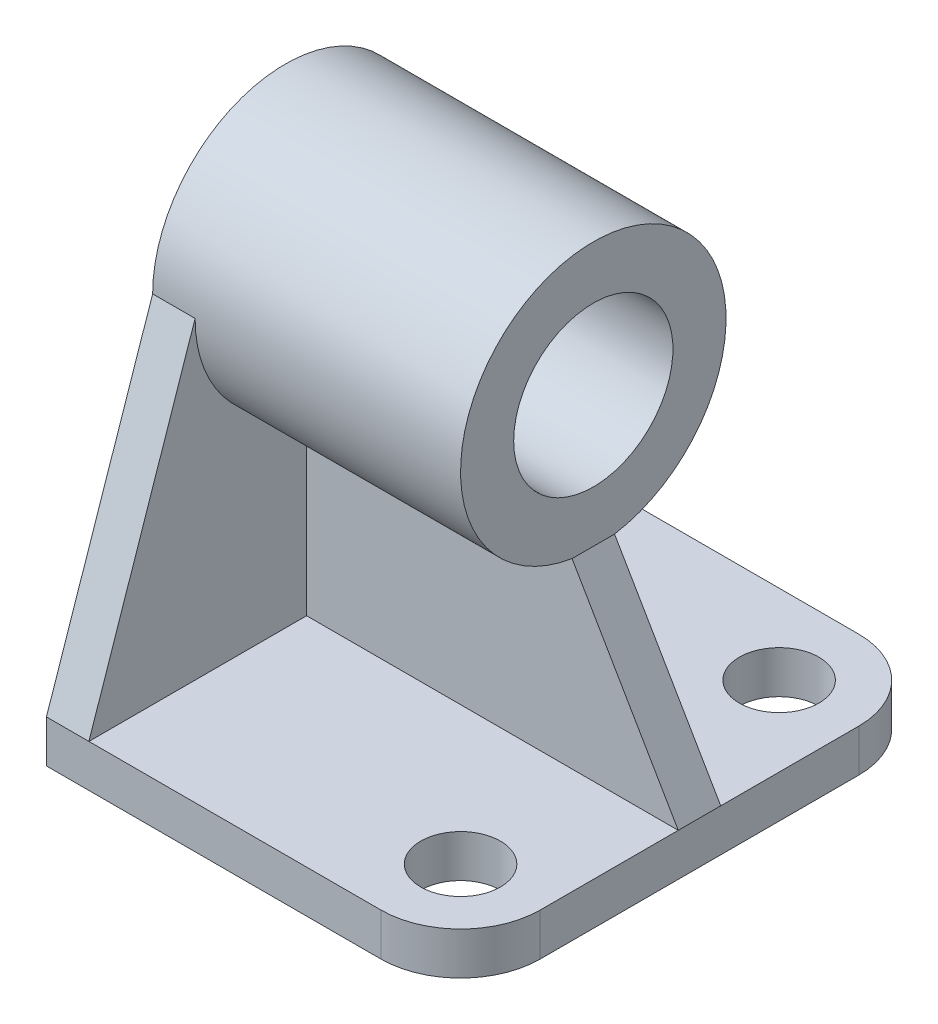
ISO-10303-21;
HEADER;
FILE_DESCRIPTION(('STEP AP214'),'2;1');
FILE_NAME('part.step','',(''),(''),'','','');
FILE_SCHEMA(('AUTOMOTIVE_DESIGN { 1 0 10303 214 1 1 1 1 }'));
ENDSEC;
DATA;
#1=APPLICATION_CONTEXT('core data for automotive mechanical design processes');
#2=APPLICATION_PROTOCOL_DEFINITION('international standard','automotive_design',2000,#1);
#3=PRODUCT_CONTEXT('',#1,'mechanical');
#4=PRODUCT('Part','Part','',(#3));
#5=PRODUCT_RELATED_PRODUCT_CATEGORY('part','',(#4));
#6=PRODUCT_DEFINITION_FORMATION('','',#4);
#7=PRODUCT_DEFINITION_CONTEXT('part definition',#1,'design');
#8=PRODUCT_DEFINITION('design','',#6,#7);
#9=PRODUCT_DEFINITION_SHAPE('','',#8);
#10=(LENGTH_UNIT() NAMED_UNIT(*) SI_UNIT(.MILLI.,.METRE.));
#11=(NAMED_UNIT(*) PLANE_ANGLE_UNIT() SI_UNIT($,.RADIAN.));
#12=(NAMED_UNIT(*) SI_UNIT($,.STERADIAN.) SOLID_ANGLE_UNIT());
#13=UNCERTAINTY_MEASURE_WITH_UNIT(LENGTH_MEASURE(1.E-05),#10,'distance_accuracy_value','');
#14=(GEOMETRIC_REPRESENTATION_CONTEXT(3) GLOBAL_UNCERTAINTY_ASSIGNED_CONTEXT((#13)) GLOBAL_UNIT_ASSIGNED_CONTEXT((#10,
#11,#12)) REPRESENTATION_CONTEXT('',''));
#15=CARTESIAN_POINT('',(0.,0.,0.));
#16=DIRECTION('',(0.,0.,1.));
#17=DIRECTION('',(1.,0.,0.));
#18=AXIS2_PLACEMENT_3D('',#15,#16,#17);
#19=CARTESIAN_POINT('',(58.4548841351671,8.,11.6222556390977));
#20=DIRECTION('',(0.,1.,0.));
#21=DIRECTION('',(0.,0.,1.));
#22=AXIS2_PLACEMENT_3D('',#19,#20,#21);
#23=PLANE('',#22);
#24=DIRECTION('',(-1.,0.,0.));
#25=VECTOR('',#24,1.);
#26=CARTESIAN_POINT('',(73.4548841351671,7.99999999999999,-14.3777443609023));
#27=LINE('',#26,#25);
#28=CARTESIAN_POINT('',(73.4548841351671,8.,-14.3777443609023));
#29=VERTEX_POINT('',#28);
#30=CARTESIAN_POINT('',(3.4548841351671,7.99999999999999,-14.3777443609023));
#31=VERTEX_POINT('',#30);
#32=EDGE_CURVE('E252',#29,#31,#27,.T.);
#33=ORIENTED_EDGE('',*,*,#32,.T.);
#34=DIRECTION('',(0.,0.,-1.));
#35=VECTOR('',#34,1.);
#36=CARTESIAN_POINT('',(3.45488413516711,8.,0.));
#37=LINE('',#36,#35);
#38=CARTESIAN_POINT('',(3.4548841351671,8.,26.6222556390977));
#39=VERTEX_POINT('',#38);
#40=EDGE_CURVE('E55',#39,#31,#37,.T.);
#41=ORIENTED_EDGE('',*,*,#40,.F.);
#42=DIRECTION('',(1.,0.,0.));
#43=VECTOR('',#42,1.);
#44=CARTESIAN_POINT('',(-4.54511586483289,8.,26.6222556390977));
#45=LINE('',#44,#43);
#46=CARTESIAN_POINT('',(58.454884135167,8.,26.6222556390977));
#47=VERTEX_POINT('',#46);
#48=EDGE_CURVE('E167',#39,#47,#45,.T.);
#49=ORIENTED_EDGE('',*,*,#48,.T.);
#50=CARTESIAN_POINT('',(58.4548841351671,8.,11.6222556390977));
#51=DIRECTION('',(0.,1.,0.));
#52=DIRECTION('',(0.,0.,1.));
#53=AXIS2_PLACEMENT_3D('',#50,#51,#52);
#54=CIRCLE('',#53,15.);
#55=CARTESIAN_POINT('',(73.4548841351671,8.,11.6222556390976));
#56=VERTEX_POINT('',#55);
#57=EDGE_CURVE('E124',#47,#56,#54,.T.);
#58=ORIENTED_EDGE('',*,*,#57,.T.);
#59=DIRECTION('',(0.,0.,-1.));
#60=VECTOR('',#59,1.);
#61=CARTESIAN_POINT('',(73.4548841351671,8.,11.6222556390976));
#62=LINE('',#61,#60);
#63=EDGE_CURVE('E123',#56,#29,#62,.T.);
#64=ORIENTED_EDGE('',*,*,#63,.T.);
#65=EDGE_LOOP('',(#33,#41,#49,#58,#64));
#66=FACE_BOUND('',#65,.T.);
#67=CARTESIAN_POINT('',(58.4548841351671,8.,11.6222556390977));
#68=DIRECTION('',(0.,1.,0.));
#69=DIRECTION('',(0.,0.,1.));
#70=AXIS2_PLACEMENT_3D('',#67,#68,#69);
#71=CIRCLE('',#70,7.5);
#72=CARTESIAN_POINT('',(58.4548841351671,8.,19.1222556390977));
#73=VERTEX_POINT('',#72);
#74=EDGE_CURVE('E154',#73,#73,#71,.T.);
#75=ORIENTED_EDGE('',*,*,#74,.F.);
#76=EDGE_LOOP('',(#75));
#77=FACE_BOUND('',#76,.T.);
#78=ADVANCED_FACE('F39',(#66,#77),#23,.T.);
#79=CARTESIAN_POINT('',(3.45488413516711,0.,0.));
#80=DIRECTION('',(-1.,0.,0.));
#81=DIRECTION('',(0.,0.,1.));
#82=AXIS2_PLACEMENT_3D('',#79,#80,#81);
#83=PLANE('',#82);
#84=ORIENTED_EDGE('',*,*,#40,.T.);
#85=DIRECTION('',(0.,1.,0.));
#86=VECTOR('',#85,1.);
#87=CARTESIAN_POINT('',(3.45488413516711,0.,-14.3777443609023));
#88=LINE('',#87,#86);
#89=CARTESIAN_POINT('',(3.45488413516712,42.3220746414939,-14.3777443609023));
#90=VERTEX_POINT('',#89);
#91=EDGE_CURVE('E265',#31,#90,#88,.T.);
#92=ORIENTED_EDGE('',*,*,#91,.T.);
#93=CARTESIAN_POINT('',(3.4548841351671,67.,-18.3777443609023));
#94=DIRECTION('',(-1.,0.,0.));
#95=DIRECTION('',(0.,0.,1.));
#96=AXIS2_PLACEMENT_3D('',#93,#94,#95);
#97=CIRCLE('',#96,25.);
#98=CARTESIAN_POINT('',(3.45488413516711,67.,6.62225563909774));
#99=VERTEX_POINT('',#98);
#100=EDGE_CURVE('E290',#90,#99,#97,.T.);
#101=ORIENTED_EDGE('',*,*,#100,.T.);
#102=DIRECTION('',(0.,0.947065879415799,-0.321039281157898));
#103=VECTOR('',#102,1.);
#104=CARTESIAN_POINT('',(3.45488413516711,8.91890277097019,26.3107631743621));
#105=LINE('',#104,#103);
#106=EDGE_CURVE('E295',#39,#99,#105,.T.);
#107=ORIENTED_EDGE('',*,*,#106,.F.);
#108=EDGE_LOOP('',(#84,#92,#101,#107));
#109=FACE_BOUND('',#108,.T.);
#110=ADVANCED_FACE('F340',(#109),#83,.F.);
#111=DIRECTION('',(-1.,0.,0.));
#112=VECTOR('',#111,1.);
#113=CARTESIAN_POINT('',(73.4548841351671,7.99999999999999,-22.3777443609023));
#114=LINE('',#113,#112);
#115=CARTESIAN_POINT('',(73.4548841351671,8.,-22.3777443609023));
#116=VERTEX_POINT('',#115);
#117=CARTESIAN_POINT('',(3.4548841351671,7.99999999999999,-22.3777443609023));
#118=VERTEX_POINT('',#117);
#119=EDGE_CURVE('E119',#116,#118,#114,.T.);
#120=ORIENTED_EDGE('',*,*,#119,.F.);
#121=CARTESIAN_POINT('',(73.4548841351671,8.,-48.3777443609023));
#122=VERTEX_POINT('',#121);
#123=EDGE_CURVE('E108',#116,#122,#62,.T.);
#124=ORIENTED_EDGE('',*,*,#123,.T.);
#125=CARTESIAN_POINT('',(58.4548841351671,8.,-48.3777443609023));
#126=DIRECTION('',(0.,1.,0.));
#127=DIRECTION('',(0.,0.,1.));
#128=AXIS2_PLACEMENT_3D('',#125,#126,#127);
#129=CIRCLE('',#128,15.);
#130=CARTESIAN_POINT('',(58.4548841351671,8.,-63.3777443609023));
#131=VERTEX_POINT('',#130);
#132=EDGE_CURVE('E114',#122,#131,#129,.T.);
#133=ORIENTED_EDGE('',*,*,#132,.T.);
#134=DIRECTION('',(-1.,0.,0.));
#135=VECTOR('',#134,1.);
#136=CARTESIAN_POINT('',(58.4548841351671,8.,-63.3777443609023));
#137=LINE('',#136,#135);
#138=CARTESIAN_POINT('',(3.4548841351671,8.,-63.3777443609023));
#139=VERTEX_POINT('',#138);
#140=EDGE_CURVE('E141',#131,#139,#137,.T.);
#141=ORIENTED_EDGE('',*,*,#140,.T.);
#142=EDGE_CURVE('E191',#118,#139,#37,.T.);
#143=ORIENTED_EDGE('',*,*,#142,.F.);
#144=EDGE_LOOP('',(#120,#124,#133,#141,#143));
#145=FACE_BOUND('',#144,.T.);
#146=CARTESIAN_POINT('',(58.4548841351671,8.,-48.3777443609023));
#147=DIRECTION('',(0.,1.,0.));
#148=DIRECTION('',(0.,0.,1.));
#149=AXIS2_PLACEMENT_3D('',#146,#147,#148);
#150=CIRCLE('',#149,7.5);
#151=CARTESIAN_POINT('',(58.4548841351671,8.,-40.8777443609023));
#152=VERTEX_POINT('',#151);
#153=EDGE_CURVE('E316',#152,#152,#150,.T.);
#154=ORIENTED_EDGE('',*,*,#153,.F.);
#155=EDGE_LOOP('',(#154));
#156=FACE_BOUND('',#155,.T.);
#157=ADVANCED_FACE('F110',(#145,#156),#23,.T.);
#158=CARTESIAN_POINT('',(58.4548841351671,0.,11.6222556390977));
#159=DIRECTION('',(0.,1.,0.));
#160=DIRECTION('',(0.,0.,1.));
#161=AXIS2_PLACEMENT_3D('',#158,#159,#160);
#162=PLANE('',#161);
#163=DIRECTION('',(0.,0.,1.));
#164=VECTOR('',#163,1.);
#165=CARTESIAN_POINT('',(-4.5451158648329,0.,-63.3777443609023));
#166=LINE('',#165,#164);
#167=CARTESIAN_POINT('',(-4.5451158648329,0.,-63.3777443609023));
#168=VERTEX_POINT('',#167);
#169=CARTESIAN_POINT('',(-4.54511586483289,0.,26.6222556390977));
#170=VERTEX_POINT('',#169);
#171=EDGE_CURVE('E149',#168,#170,#166,.T.);
#172=ORIENTED_EDGE('',*,*,#171,.F.);
#173=DIRECTION('',(-1.,0.,0.));
#174=VECTOR('',#173,1.);
#175=CARTESIAN_POINT('',(58.4548841351671,0.,-63.3777443609023));
#176=LINE('',#175,#174);
#177=CARTESIAN_POINT('',(58.4548841351671,0.,-63.3777443609023));
#178=VERTEX_POINT('',#177);
#179=EDGE_CURVE('E90',#178,#168,#176,.T.);
#180=ORIENTED_EDGE('',*,*,#179,.F.);
#181=CARTESIAN_POINT('',(58.4548841351671,0.,-48.3777443609023));
#182=DIRECTION('',(0.,1.,0.));
#183=DIRECTION('',(0.,0.,1.));
#184=AXIS2_PLACEMENT_3D('',#181,#182,#183);
#185=CIRCLE('',#184,15.);
#186=CARTESIAN_POINT('',(73.4548841351671,0.,-48.3777443609023));
#187=VERTEX_POINT('',#186);
#188=EDGE_CURVE('E162',#187,#178,#185,.T.);
#189=ORIENTED_EDGE('',*,*,#188,.F.);
#190=DIRECTION('',(0.,0.,-1.));
#191=VECTOR('',#190,1.);
#192=CARTESIAN_POINT('',(73.4548841351671,0.,11.6222556390976));
#193=LINE('',#192,#191);
#194=CARTESIAN_POINT('',(73.4548841351671,0.,11.6222556390976));
#195=VERTEX_POINT('',#194);
#196=EDGE_CURVE('E131',#195,#187,#193,.T.);
#197=ORIENTED_EDGE('',*,*,#196,.F.);
#198=CARTESIAN_POINT('',(58.4548841351671,0.,11.6222556390977));
#199=DIRECTION('',(0.,1.,0.));
#200=DIRECTION('',(0.,0.,1.));
#201=AXIS2_PLACEMENT_3D('',#198,#199,#200);
#202=CIRCLE('',#201,15.);
#203=CARTESIAN_POINT('',(58.454884135167,0.,26.6222556390977));
#204=VERTEX_POINT('',#203);
#205=EDGE_CURVE('E157',#204,#195,#202,.T.);
#206=ORIENTED_EDGE('',*,*,#205,.F.);
#207=DIRECTION('',(1.,0.,0.));
#208=VECTOR('',#207,1.);
#209=CARTESIAN_POINT('',(-4.54511586483289,0.,26.6222556390977));
#210=LINE('',#209,#208);
#211=EDGE_CURVE('E153',#170,#204,#210,.T.);
#212=ORIENTED_EDGE('',*,*,#211,.F.);
#213=EDGE_LOOP('',(#172,#180,#189,#197,#206,#212));
#214=FACE_BOUND('',#213,.T.);
#215=CARTESIAN_POINT('',(58.4548841351671,0.,11.6222556390977));
#216=DIRECTION('',(0.,1.,0.));
#217=DIRECTION('',(0.,0.,1.));
#218=AXIS2_PLACEMENT_3D('',#215,#216,#217);
#219=CIRCLE('',#218,7.5);
#220=CARTESIAN_POINT('',(58.4548841351671,0.,19.1222556390977));
#221=VERTEX_POINT('',#220);
#222=EDGE_CURVE('E320',#221,#221,#219,.T.);
#223=ORIENTED_EDGE('',*,*,#222,.T.);
#224=EDGE_LOOP('',(#223));
#225=FACE_BOUND('',#224,.T.);
#226=CARTESIAN_POINT('',(58.4548841351671,0.,-48.3777443609023));
#227=DIRECTION('',(0.,1.,0.));
#228=DIRECTION('',(0.,0.,1.));
#229=AXIS2_PLACEMENT_3D('',#226,#227,#228);
#230=CIRCLE('',#229,7.5);
#231=CARTESIAN_POINT('',(58.4548841351671,0.,-40.8777443609023));
#232=VERTEX_POINT('',#231);
#233=EDGE_CURVE('E311',#232,#232,#230,.T.);
#234=ORIENTED_EDGE('',*,*,#233,.T.);
#235=EDGE_LOOP('',(#234));
#236=FACE_BOUND('',#235,.T.);
#237=ADVANCED_FACE('F183',(#214,#225,#236),#162,.F.);
#238=CARTESIAN_POINT('',(-4.5451158648329,8.,-63.3777443609023));
#239=DIRECTION('',(1.,0.,0.));
#240=DIRECTION('',(0.,0.,-1.));
#241=AXIS2_PLACEMENT_3D('',#238,#239,#240);
#242=PLANE('',#241);
#243=ORIENTED_EDGE('',*,*,#171,.T.);
#244=DIRECTION('',(0.,-1.,0.));
#245=VECTOR('',#244,1.);
#246=CARTESIAN_POINT('',(-4.54511586483289,8.,26.6222556390977));
#247=LINE('',#246,#245);
#248=CARTESIAN_POINT('',(-4.54511586483289,8.,26.6222556390977));
#249=VERTEX_POINT('',#248);
#250=EDGE_CURVE('E11',#249,#170,#247,.T.);
#251=ORIENTED_EDGE('',*,*,#250,.F.);
#252=DIRECTION('',(0.,0.947065879415799,-0.321039281157898));
#253=VECTOR('',#252,1.);
#254=CARTESIAN_POINT('',(-4.54511586483289,8.91890277097019,26.3107631743621));
#255=LINE('',#254,#253);
#256=CARTESIAN_POINT('',(-4.54511586483289,67.,6.62225563909774));
#257=VERTEX_POINT('',#256);
#258=EDGE_CURVE('E303',#249,#257,#255,.T.);
#259=ORIENTED_EDGE('',*,*,#258,.T.);
#260=CARTESIAN_POINT('',(-4.5451158648329,67.,-18.3777443609023));
#261=DIRECTION('',(-1.,0.,0.));
#262=DIRECTION('',(0.,0.,1.));
#263=AXIS2_PLACEMENT_3D('',#260,#261,#262);
#264=CIRCLE('',#263,25.);
#265=CARTESIAN_POINT('',(-4.5451158648329,67.,-43.3777443609023));
#266=VERTEX_POINT('',#265);
#267=EDGE_CURVE('E275',#257,#266,#264,.T.);
#268=ORIENTED_EDGE('',*,*,#267,.T.);
#269=DIRECTION('',(0.,-0.947065879415799,-0.321039281157898));
#270=VECTOR('',#269,1.);
#271=CARTESIAN_POINT('',(-4.5451158648329,20.0942381720857,-59.2780026076529));
#272=LINE('',#271,#270);
#273=CARTESIAN_POINT('',(-4.5451158648329,8.,-63.3777443609023));
#274=VERTEX_POINT('',#273);
#275=EDGE_CURVE('E278',#266,#274,#272,.T.);
#276=ORIENTED_EDGE('',*,*,#275,.T.);
#277=DIRECTION('',(0.,-1.,0.));
#278=VECTOR('',#277,1.);
#279=CARTESIAN_POINT('',(-4.5451158648329,8.,-63.3777443609023));
#280=LINE('',#279,#278);
#281=EDGE_CURVE('E64',#274,#168,#280,.T.);
#282=ORIENTED_EDGE('',*,*,#281,.T.);
#283=EDGE_LOOP('',(#243,#251,#259,#268,#276,#282));
#284=FACE_BOUND('',#283,.T.);
#285=CARTESIAN_POINT('',(-4.5451158648329,67.,-18.3777443609023));
#286=DIRECTION('',(-1.,0.,0.));
#287=DIRECTION('',(0.,0.,1.));
#288=AXIS2_PLACEMENT_3D('',#285,#286,#287);
#289=CIRCLE('',#288,15.);
#290=CARTESIAN_POINT('',(-4.54511586483289,67.,-3.37774436090226));
#291=VERTEX_POINT('',#290);
#292=EDGE_CURVE('E269',#291,#291,#289,.T.);
#293=ORIENTED_EDGE('',*,*,#292,.F.);
#294=EDGE_LOOP('',(#293));
#295=FACE_BOUND('',#294,.T.);
#296=ADVANCED_FACE('F41',(#284,#295),#242,.F.);
#297=CARTESIAN_POINT('',(-4.54511586483289,8.,26.6222556390977));
#298=DIRECTION('',(0.,0.,-1.));
#299=DIRECTION('',(-1.,0.,0.));
#300=AXIS2_PLACEMENT_3D('',#297,#298,#299);
#301=PLANE('',#300);
#302=ORIENTED_EDGE('',*,*,#211,.T.);
#303=DIRECTION('',(0.,-1.,0.));
#304=VECTOR('',#303,1.);
#305=CARTESIAN_POINT('',(58.454884135167,8.,26.6222556390977));
#306=LINE('',#305,#304);
#307=EDGE_CURVE('E48',#47,#204,#306,.T.);
#308=ORIENTED_EDGE('',*,*,#307,.F.);
#309=ORIENTED_EDGE('',*,*,#48,.F.);
#310=EDGE_CURVE('E96',#249,#39,#45,.T.);
#311=ORIENTED_EDGE('',*,*,#310,.F.);
#312=ORIENTED_EDGE('',*,*,#250,.T.);
#313=EDGE_LOOP('',(#302,#308,#309,#311,#312));
#314=FACE_BOUND('',#313,.T.);
#315=ADVANCED_FACE('F350',(#314),#301,.F.);
#316=CARTESIAN_POINT('',(58.4548841351671,8.,11.6222556390977));
#317=DIRECTION('',(0.,-1.,0.));
#318=DIRECTION('',(0.,0.,-1.));
#319=AXIS2_PLACEMENT_3D('',#316,#317,#318);
#320=CYLINDRICAL_SURFACE('',#319,15.);
#321=ORIENTED_EDGE('',*,*,#205,.T.);
#322=DIRECTION('',(0.,-1.,0.));
#323=VECTOR('',#322,1.);
#324=CARTESIAN_POINT('',(73.4548841351671,8.,11.6222556390976));
#325=LINE('',#324,#323);
#326=EDGE_CURVE('E135',#56,#195,#325,.T.);
#327=ORIENTED_EDGE('',*,*,#326,.F.);
#328=ORIENTED_EDGE('',*,*,#57,.F.);
#329=ORIENTED_EDGE('',*,*,#307,.T.);
#330=EDGE_LOOP('',(#321,#327,#328,#329));
#331=FACE_BOUND('',#330,.T.);
#332=ADVANCED_FACE('F179',(#331),#320,.T.);
#333=CARTESIAN_POINT('',(73.4548841351671,8.,11.6222556390976));
#334=DIRECTION('',(-1.,0.,0.));
#335=DIRECTION('',(0.,0.,1.));
#336=AXIS2_PLACEMENT_3D('',#333,#334,#335);
#337=PLANE('',#336);
#338=ORIENTED_EDGE('',*,*,#123,.F.);
#339=DIRECTION('',(0.,0.,-1.));
#340=VECTOR('',#339,1.);
#341=CARTESIAN_POINT('',(73.4548841351671,8.,55.6222556390977));
#342=LINE('',#341,#340);
#343=EDGE_CURVE('E228',#29,#116,#342,.T.);
#344=ORIENTED_EDGE('',*,*,#343,.F.);
#345=ORIENTED_EDGE('',*,*,#63,.F.);
#346=ORIENTED_EDGE('',*,*,#326,.T.);
#347=ORIENTED_EDGE('',*,*,#196,.T.);
#348=DIRECTION('',(0.,-1.,0.));
#349=VECTOR('',#348,1.);
#350=CARTESIAN_POINT('',(73.4548841351671,8.,-48.3777443609023));
#351=LINE('',#350,#349);
#352=EDGE_CURVE('E127',#122,#187,#351,.T.);
#353=ORIENTED_EDGE('',*,*,#352,.F.);
#354=EDGE_LOOP('',(#338,#344,#345,#346,#347,#353));
#355=FACE_BOUND('',#354,.T.);
#356=ADVANCED_FACE('F128',(#355),#337,.F.);
#357=CARTESIAN_POINT('',(58.4548841351671,8.,-48.3777443609023));
#358=DIRECTION('',(0.,-1.,0.));
#359=DIRECTION('',(0.,0.,-1.));
#360=AXIS2_PLACEMENT_3D('',#357,#358,#359);
#361=CYLINDRICAL_SURFACE('',#360,15.);
#362=ORIENTED_EDGE('',*,*,#188,.T.);
#363=DIRECTION('',(0.,-1.,0.));
#364=VECTOR('',#363,1.);
#365=CARTESIAN_POINT('',(58.4548841351671,8.,-63.3777443609023));
#366=LINE('',#365,#364);
#367=EDGE_CURVE('E136',#131,#178,#366,.T.);
#368=ORIENTED_EDGE('',*,*,#367,.F.);
#369=ORIENTED_EDGE('',*,*,#132,.F.);
#370=ORIENTED_EDGE('',*,*,#352,.T.);
#371=EDGE_LOOP('',(#362,#368,#369,#370));
#372=FACE_BOUND('',#371,.T.);
#373=ADVANCED_FACE('F138',(#372),#361,.T.);
#374=CARTESIAN_POINT('',(58.4548841351671,8.,-63.3777443609023));
#375=DIRECTION('',(0.,0.,1.));
#376=DIRECTION('',(1.,0.,0.));
#377=AXIS2_PLACEMENT_3D('',#374,#375,#376);
#378=PLANE('',#377);
#379=ORIENTED_EDGE('',*,*,#179,.T.);
#380=ORIENTED_EDGE('',*,*,#281,.F.);
#381=DIRECTION('',(-1.,0.,0.));
#382=VECTOR('',#381,1.);
#383=CARTESIAN_POINT('',(3.4548841351671,8.,-63.3777443609023));
#384=LINE('',#383,#382);
#385=EDGE_CURVE('E187',#139,#274,#384,.T.);
#386=ORIENTED_EDGE('',*,*,#385,.F.);
#387=ORIENTED_EDGE('',*,*,#140,.F.);
#388=ORIENTED_EDGE('',*,*,#367,.T.);
#389=EDGE_LOOP('',(#379,#380,#386,#387,#388));
#390=FACE_BOUND('',#389,.T.);
#391=ADVANCED_FACE('F185',(#390),#378,.F.);
#392=CARTESIAN_POINT('',(58.4548841351671,8.,11.6222556390977));
#393=DIRECTION('',(0.,-1.,0.));
#394=DIRECTION('',(0.,0.,-1.));
#395=AXIS2_PLACEMENT_3D('',#392,#393,#394);
#396=CYLINDRICAL_SURFACE('',#395,7.5);
#397=ORIENTED_EDGE('',*,*,#74,.T.);
#398=EDGE_LOOP('',(#397));
#399=FACE_BOUND('',#398,.T.);
#400=ORIENTED_EDGE('',*,*,#222,.F.);
#401=EDGE_LOOP('',(#400));
#402=FACE_BOUND('',#401,.T.);
#403=ADVANCED_FACE('F375',(#399,#402),#396,.F.);
#404=CARTESIAN_POINT('',(58.4548841351671,8.,-48.3777443609023));
#405=DIRECTION('',(0.,-1.,0.));
#406=DIRECTION('',(0.,0.,-1.));
#407=AXIS2_PLACEMENT_3D('',#404,#405,#406);
#408=CYLINDRICAL_SURFACE('',#407,7.5);
#409=ORIENTED_EDGE('',*,*,#153,.T.);
#410=EDGE_LOOP('',(#409));
#411=FACE_BOUND('',#410,.T.);
#412=ORIENTED_EDGE('',*,*,#233,.F.);
#413=EDGE_LOOP('',(#412));
#414=FACE_BOUND('',#413,.T.);
#415=ADVANCED_FACE('F399',(#411,#414),#408,.F.);
#416=CARTESIAN_POINT('',(3.45488413516711,8.91890277097019,26.3107631743621));
#417=DIRECTION('',(0.,0.321039281157898,0.947065879415799));
#418=DIRECTION('',(0.,-0.947065879415799,0.321039281157898));
#419=AXIS2_PLACEMENT_3D('',#416,#417,#418);
#420=PLANE('',#419);
#421=ORIENTED_EDGE('',*,*,#258,.F.);
#422=ORIENTED_EDGE('',*,*,#310,.T.);
#423=ORIENTED_EDGE('',*,*,#106,.T.);
#424=DIRECTION('',(-1.,0.,0.));
#425=VECTOR('',#424,1.);
#426=CARTESIAN_POINT('',(3.45488413516711,67.,6.62225563909774));
#427=LINE('',#426,#425);
#428=EDGE_CURVE('E307',#99,#257,#427,.T.);
#429=ORIENTED_EDGE('',*,*,#428,.T.);
#430=EDGE_LOOP('',(#421,#422,#423,#429));
#431=FACE_BOUND('',#430,.T.);
#432=ADVANCED_FACE('F346',(#431),#420,.T.);
#433=CARTESIAN_POINT('',(3.4548841351671,20.0942381720857,-59.2780026076529));
#434=DIRECTION('',(0.,0.321039281157898,-0.947065879415799));
#435=DIRECTION('',(0.,0.947065879415799,0.321039281157898));
#436=AXIS2_PLACEMENT_3D('',#433,#434,#435);
#437=PLANE('',#436);
#438=ORIENTED_EDGE('',*,*,#275,.F.);
#439=DIRECTION('',(-1.,0.,0.));
#440=VECTOR('',#439,1.);
#441=CARTESIAN_POINT('',(3.4548841351671,67.,-43.3777443609023));
#442=LINE('',#441,#440);
#443=CARTESIAN_POINT('',(3.4548841351671,67.,-43.3777443609023));
#444=VERTEX_POINT('',#443);
#445=EDGE_CURVE('E299',#444,#266,#442,.T.);
#446=ORIENTED_EDGE('',*,*,#445,.F.);
#447=DIRECTION('',(0.,-0.947065879415799,-0.321039281157898));
#448=VECTOR('',#447,1.);
#449=CARTESIAN_POINT('',(3.4548841351671,20.0942381720857,-59.2780026076529));
#450=LINE('',#449,#448);
#451=EDGE_CURVE('E289',#444,#139,#450,.T.);
#452=ORIENTED_EDGE('',*,*,#451,.T.);
#453=ORIENTED_EDGE('',*,*,#385,.T.);
#454=EDGE_LOOP('',(#438,#446,#452,#453));
#455=FACE_BOUND('',#454,.T.);
#456=ADVANCED_FACE('F412',(#455),#437,.T.);
#457=CARTESIAN_POINT('',(3.45488413516712,42.3220746414939,-22.3777443609023));
#458=VERTEX_POINT('',#457);
#459=EDGE_CURVE('E285',#444,#458,#97,.T.);
#460=ORIENTED_EDGE('',*,*,#459,.T.);
#461=DIRECTION('',(0.,-1.,0.));
#462=VECTOR('',#461,1.);
#463=CARTESIAN_POINT('',(3.4548841351671,0.,-22.3777443609023));
#464=LINE('',#463,#462);
#465=EDGE_CURVE('E259',#458,#118,#464,.T.);
#466=ORIENTED_EDGE('',*,*,#465,.T.);
#467=ORIENTED_EDGE('',*,*,#142,.T.);
#468=ORIENTED_EDGE('',*,*,#451,.F.);
#469=EDGE_LOOP('',(#460,#466,#467,#468));
#470=FACE_BOUND('',#469,.T.);
#471=ADVANCED_FACE('F363',(#470),#83,.F.);
#472=CARTESIAN_POINT('',(53.4548841351671,67.,-18.3777443609023));
#473=DIRECTION('',(-1.,0.,0.));
#474=DIRECTION('',(0.,0.,1.));
#475=AXIS2_PLACEMENT_3D('',#472,#473,#474);
#476=CYLINDRICAL_SURFACE('',#475,15.);
#477=CARTESIAN_POINT('',(53.4548841351671,67.,-18.3777443609023));
#478=DIRECTION('',(-1.,0.,0.));
#479=DIRECTION('',(0.,0.,1.));
#480=AXIS2_PLACEMENT_3D('',#477,#478,#479);
#481=CIRCLE('',#480,15.);
#482=CARTESIAN_POINT('',(53.4548841351671,67.,-3.37774436090227));
#483=VERTEX_POINT('',#482);
#484=EDGE_CURVE('E270',#483,#483,#481,.T.);
#485=ORIENTED_EDGE('',*,*,#484,.F.);
#486=EDGE_LOOP('',(#485));
#487=FACE_BOUND('',#486,.T.);
#488=ORIENTED_EDGE('',*,*,#292,.T.);
#489=EDGE_LOOP('',(#488));
#490=FACE_BOUND('',#489,.T.);
#491=ADVANCED_FACE('F427',(#487,#490),#476,.F.);
#492=CARTESIAN_POINT('',(53.4548841351671,67.,-18.3777443609023));
#493=DIRECTION('',(-1.,0.,0.));
#494=DIRECTION('',(0.,0.,1.));
#495=AXIS2_PLACEMENT_3D('',#492,#493,#494);
#496=CYLINDRICAL_SURFACE('',#495,25.);
#497=DIRECTION('',(-1.,0.,0.));
#498=VECTOR('',#497,1.);
#499=CARTESIAN_POINT('',(53.4548841351671,42.3220746414939,-14.3777443609023));
#500=LINE('',#499,#498);
#501=CARTESIAN_POINT('',(53.4548841351671,42.3220746414939,-14.3777443609023));
#502=VERTEX_POINT('',#501);
#503=EDGE_CURVE('E262',#502,#90,#500,.T.);
#504=ORIENTED_EDGE('',*,*,#503,.F.);
#505=CARTESIAN_POINT('',(53.4548841351671,67.,-18.3777443609023));
#506=DIRECTION('',(-1.,0.,0.));
#507=DIRECTION('',(0.,0.,1.));
#508=AXIS2_PLACEMENT_3D('',#505,#506,#507);
#509=CIRCLE('',#508,25.);
#510=CARTESIAN_POINT('',(53.4548841351671,42.3220746414939,-22.3777443609023));
#511=VERTEX_POINT('',#510);
#512=EDGE_CURVE('E274',#502,#511,#509,.T.);
#513=ORIENTED_EDGE('',*,*,#512,.T.);
#514=DIRECTION('',(-1.,0.,0.));
#515=VECTOR('',#514,1.);
#516=CARTESIAN_POINT('',(53.4548841351671,42.3220746414939,-22.3777443609023));
#517=LINE('',#516,#515);
#518=EDGE_CURVE('E243',#458,#511,#517,.F.);
#519=ORIENTED_EDGE('',*,*,#518,.F.);
#520=ORIENTED_EDGE('',*,*,#459,.F.);
#521=ORIENTED_EDGE('',*,*,#445,.T.);
#522=ORIENTED_EDGE('',*,*,#267,.F.);
#523=ORIENTED_EDGE('',*,*,#428,.F.);
#524=ORIENTED_EDGE('',*,*,#100,.F.);
#525=EDGE_LOOP('',(#504,#513,#519,#520,#521,#522,#523,#524));
#526=FACE_BOUND('',#525,.T.);
#527=ADVANCED_FACE('F343',(#526),#496,.T.);
#528=CARTESIAN_POINT('',(53.4548841351671,0.,0.));
#529=DIRECTION('',(-1.,0.,0.));
#530=DIRECTION('',(0.,0.,1.));
#531=AXIS2_PLACEMENT_3D('',#528,#529,#530);
#532=PLANE('',#531);
#533=DIRECTION('',(0.,0.,-1.));
#534=VECTOR('',#533,1.);
#535=CARTESIAN_POINT('',(53.4548841351671,42.3220746414939,55.6222556390977));
#536=LINE('',#535,#534);
#537=EDGE_CURVE('E238',#502,#511,#536,.T.);
#538=ORIENTED_EDGE('',*,*,#537,.T.);
#539=ORIENTED_EDGE('',*,*,#512,.F.);
#540=EDGE_LOOP('',(#538,#539));
#541=FACE_BOUND('',#540,.T.);
#542=ORIENTED_EDGE('',*,*,#484,.T.);
#543=EDGE_LOOP('',(#542));
#544=FACE_BOUND('',#543,.T.);
#545=ADVANCED_FACE('F440',(#541,#544),#532,.F.);
#546=CARTESIAN_POINT('',(73.4548841351671,47.5017654980094,-14.3777443609023));
#547=DIRECTION('',(0.,0.,1.));
#548=DIRECTION('',(1.,0.,0.));
#549=AXIS2_PLACEMENT_3D('',#546,#547,#548);
#550=PLANE('',#549);
#551=DIRECTION('',(0.503472593390947,-0.864011196515528,0.));
#552=VECTOR('',#551,1.);
#553=CARTESIAN_POINT('',(56.2713807987892,37.4886742056761,-14.3777443609023));
#554=LINE('',#553,#552);
#555=EDGE_CURVE('E234',#502,#29,#554,.T.);
#556=ORIENTED_EDGE('',*,*,#555,.F.);
#557=ORIENTED_EDGE('',*,*,#503,.T.);
#558=ORIENTED_EDGE('',*,*,#91,.F.);
#559=ORIENTED_EDGE('',*,*,#32,.F.);
#560=EDGE_LOOP('',(#556,#557,#558,#559));
#561=FACE_BOUND('',#560,.T.);
#562=ADVANCED_FACE('F447',(#561),#550,.T.);
#563=CARTESIAN_POINT('',(73.4548841351671,47.5017654980094,-22.3777443609023));
#564=DIRECTION('',(0.,0.,-1.));
#565=DIRECTION('',(-1.,0.,0.));
#566=AXIS2_PLACEMENT_3D('',#563,#564,#565);
#567=PLANE('',#566);
#568=DIRECTION('',(-0.503472593390947,0.864011196515528,0.));
#569=VECTOR('',#568,1.);
#570=CARTESIAN_POINT('',(73.4548841351671,8.,-22.3777443609023));
#571=LINE('',#570,#569);
#572=EDGE_CURVE('E231',#116,#511,#571,.T.);
#573=ORIENTED_EDGE('',*,*,#572,.F.);
#574=ORIENTED_EDGE('',*,*,#119,.T.);
#575=ORIENTED_EDGE('',*,*,#465,.F.);
#576=ORIENTED_EDGE('',*,*,#518,.T.);
#577=EDGE_LOOP('',(#573,#574,#575,#576));
#578=FACE_BOUND('',#577,.T.);
#579=ADVANCED_FACE('F241',(#578),#567,.T.);
#580=CARTESIAN_POINT('',(73.4548841351671,8.,55.6222556390977));
#581=DIRECTION('',(-0.864011196515528,-0.503472593390947,0.));
#582=DIRECTION('',(0.503472593390947,-0.864011196515528,0.));
#583=AXIS2_PLACEMENT_3D('',#580,#581,#582);
#584=PLANE('',#583);
#585=ORIENTED_EDGE('',*,*,#555,.T.);
#586=ORIENTED_EDGE('',*,*,#343,.T.);
#587=ORIENTED_EDGE('',*,*,#572,.T.);
#588=ORIENTED_EDGE('',*,*,#537,.F.);
#589=EDGE_LOOP('',(#585,#586,#587,#588));
#590=FACE_BOUND('',#589,.T.);
#591=ADVANCED_FACE('F230',(#590),#584,.F.);
#592=CLOSED_SHELL('',(#78,#110,#157,#237,#296,#315,#332,#356,#373,#391,#403,#415,#432,#456,#471,
#491,#527,#545,#562,#579,#591));
#593=MANIFOLD_SOLID_BREP('B2',#592);
#594=ADVANCED_BREP_SHAPE_REPRESENTATION('',(#18,#593),#14);
#595=SHAPE_DEFINITION_REPRESENTATION(#9,#594);
ENDSEC;
END-ISO-10303-21;
